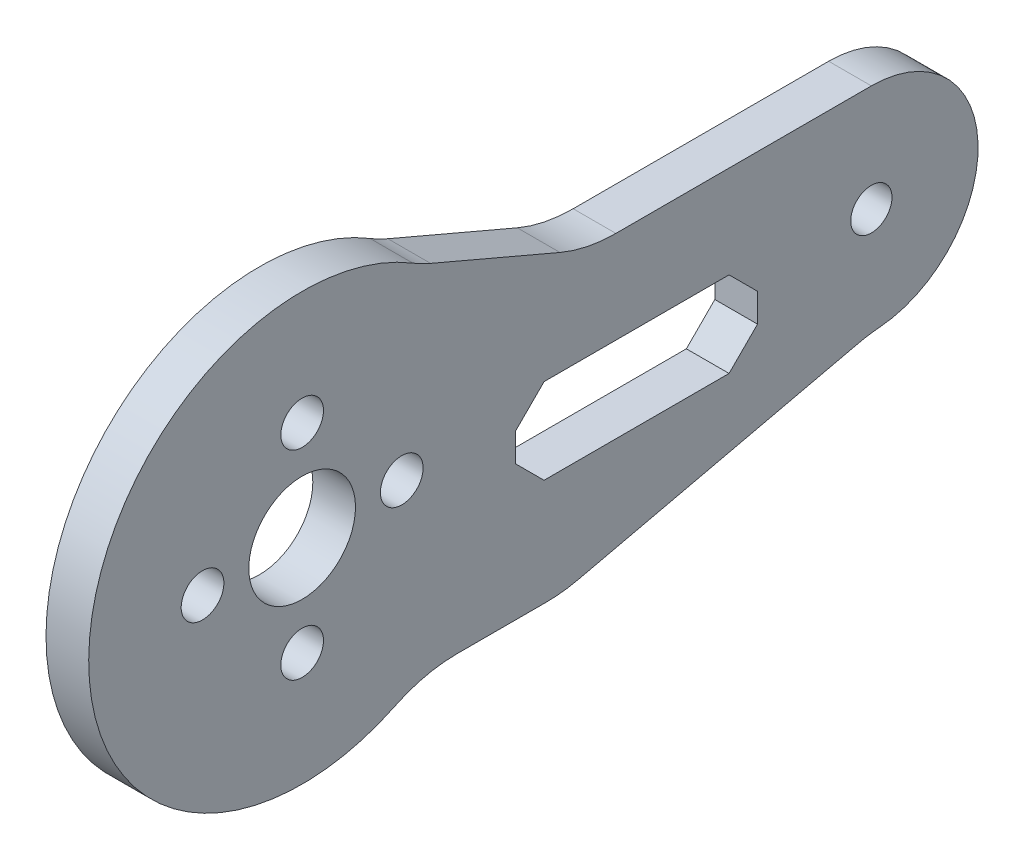
ISO-10303-21;
HEADER;
FILE_DESCRIPTION(('STEP AP214'),'2;1');
FILE_NAME('part.step','',(''),(''),'','','');
FILE_SCHEMA(('AUTOMOTIVE_DESIGN { 1 0 10303 214 1 1 1 1 }'));
ENDSEC;
DATA;
#1=APPLICATION_CONTEXT('core data for automotive mechanical design processes');
#2=APPLICATION_PROTOCOL_DEFINITION('international standard','automotive_design',2000,#1);
#3=PRODUCT_CONTEXT('',#1,'mechanical');
#4=PRODUCT('Part','Part','',(#3));
#5=PRODUCT_RELATED_PRODUCT_CATEGORY('part','',(#4));
#6=PRODUCT_DEFINITION_FORMATION('','',#4);
#7=PRODUCT_DEFINITION_CONTEXT('part definition',#1,'design');
#8=PRODUCT_DEFINITION('design','',#6,#7);
#9=PRODUCT_DEFINITION_SHAPE('','',#8);
#10=(LENGTH_UNIT() NAMED_UNIT(*) SI_UNIT(.MILLI.,.METRE.));
#11=(NAMED_UNIT(*) PLANE_ANGLE_UNIT() SI_UNIT($,.RADIAN.));
#12=(NAMED_UNIT(*) SI_UNIT($,.STERADIAN.) SOLID_ANGLE_UNIT());
#13=UNCERTAINTY_MEASURE_WITH_UNIT(LENGTH_MEASURE(1.E-05),#10,'distance_accuracy_value','');
#14=(GEOMETRIC_REPRESENTATION_CONTEXT(3) GLOBAL_UNCERTAINTY_ASSIGNED_CONTEXT((#13)) GLOBAL_UNIT_ASSIGNED_CONTEXT((#10,
#11,#12)) REPRESENTATION_CONTEXT('',''));
#15=CARTESIAN_POINT('',(0.,0.,0.));
#16=DIRECTION('',(0.,0.,1.));
#17=DIRECTION('',(1.,0.,0.));
#18=AXIS2_PLACEMENT_3D('',#15,#16,#17);
#19=CARTESIAN_POINT('',(1.5,-15.8710529420645,-3.65550320212734));
#20=DIRECTION('',(0.,-0.974485917760071,-0.224448649110017));
#21=DIRECTION('',(0.,0.224448649110017,-0.974485917760071));
#22=AXIS2_PLACEMENT_3D('',#19,#20,#21);
#23=PLANE('',#22);
#24=DIRECTION('',(0.,-0.224448649110017,0.974485917760071));
#25=VECTOR('',#24,1.);
#26=CARTESIAN_POINT('',(1.5,-15.8710529420645,-3.65550320212734));
#27=LINE('',#26,#25);
#28=CARTESIAN_POINT('',(1.5,-7.70144119055184,-39.1254052798804));
#29=VERTEX_POINT('',#28);
#30=CARTESIAN_POINT('',(1.5,-12.2448591776007,-19.3993037219836));
#31=VERTEX_POINT('',#30);
#32=EDGE_CURVE('E234',#29,#31,#27,.T.);
#33=ORIENTED_EDGE('',*,*,#32,.T.);
#34=DIRECTION('',(-1.,0.,0.));
#35=VECTOR('',#34,1.);
#36=CARTESIAN_POINT('',(1.5,-12.2448591776007,-19.3993037219836));
#37=LINE('',#36,#35);
#38=CARTESIAN_POINT('',(-1.5,-12.2448591776007,-19.3993037219836));
#39=VERTEX_POINT('',#38);
#40=EDGE_CURVE('E308',#31,#39,#37,.T.);
#41=ORIENTED_EDGE('',*,*,#40,.T.);
#42=DIRECTION('',(0.,-0.224448649110017,0.974485917760071));
#43=VECTOR('',#42,1.);
#44=CARTESIAN_POINT('',(-1.5,-15.8710529420645,-3.65550320212734));
#45=LINE('',#44,#43);
#46=CARTESIAN_POINT('',(-1.5,-7.70144119055184,-39.1254052798804));
#47=VERTEX_POINT('',#46);
#48=EDGE_CURVE('E222',#47,#39,#45,.T.);
#49=ORIENTED_EDGE('',*,*,#48,.F.);
#50=DIRECTION('',(-1.,0.,0.));
#51=VECTOR('',#50,1.);
#52=CARTESIAN_POINT('',(1.5,-7.70144119055184,-39.1254052798804));
#53=LINE('',#52,#51);
#54=EDGE_CURVE('E306',#47,#29,#53,.F.);
#55=ORIENTED_EDGE('',*,*,#54,.T.);
#56=EDGE_LOOP('',(#33,#41,#49,#55));
#57=FACE_BOUND('',#56,.T.);
#58=ADVANCED_FACE('F35',(#57),#23,.T.);
#59=CARTESIAN_POINT('',(1.5,0.,-40.));
#60=DIRECTION('',(-1.,0.,0.));
#61=DIRECTION('',(0.,0.,1.));
#62=AXIS2_PLACEMENT_3D('',#59,#60,#61);
#63=CYLINDRICAL_SURFACE('',#62,7.5);
#64=CARTESIAN_POINT('',(1.5,0.,-40.));
#65=DIRECTION('',(1.,0.,0.));
#66=DIRECTION('',(0.,0.,-1.));
#67=AXIS2_PLACEMENT_3D('',#64,#65,#66);
#68=CIRCLE('',#67,7.5);
#69=CARTESIAN_POINT('',(1.5,-7.47698587206538,-40.5870964732774));
#70=VERTEX_POINT('',#69);
#71=CARTESIAN_POINT('',(1.5,7.5,-40.));
#72=VERTEX_POINT('',#71);
#73=EDGE_CURVE('E237',#70,#72,#68,.T.);
#74=ORIENTED_EDGE('',*,*,#73,.F.);
#75=DIRECTION('',(-1.,0.,0.));
#76=VECTOR('',#75,1.);
#77=CARTESIAN_POINT('',(1.5,-7.47698587206538,-40.5870964732774));
#78=LINE('',#77,#76);
#79=CARTESIAN_POINT('',(-1.5,-7.47698587206538,-40.5870964732774));
#80=VERTEX_POINT('',#79);
#81=EDGE_CURVE('E332',#70,#80,#78,.T.);
#82=ORIENTED_EDGE('',*,*,#81,.T.);
#83=CARTESIAN_POINT('',(-1.5,0.,-40.));
#84=DIRECTION('',(1.,0.,0.));
#85=DIRECTION('',(0.,0.,-1.));
#86=AXIS2_PLACEMENT_3D('',#83,#84,#85);
#87=CIRCLE('',#86,7.5);
#88=CARTESIAN_POINT('',(-1.5,7.5,-40.));
#89=VERTEX_POINT('',#88);
#90=EDGE_CURVE('E273',#80,#89,#87,.T.);
#91=ORIENTED_EDGE('',*,*,#90,.T.);
#92=DIRECTION('',(-1.,0.,0.));
#93=VECTOR('',#92,1.);
#94=CARTESIAN_POINT('',(1.5,7.5,-40.));
#95=LINE('',#94,#93);
#96=EDGE_CURVE('E270',#72,#89,#95,.T.);
#97=ORIENTED_EDGE('',*,*,#96,.F.);
#98=EDGE_LOOP('',(#74,#82,#91,#97));
#99=FACE_BOUND('',#98,.T.);
#100=ADVANCED_FACE('F379',(#99),#63,.T.);
#101=CARTESIAN_POINT('',(1.5,7.49999999999999,0.));
#102=DIRECTION('',(0.,-1.,0.));
#103=DIRECTION('',(0.,0.,-1.));
#104=AXIS2_PLACEMENT_3D('',#101,#102,#103);
#105=PLANE('',#104);
#106=DIRECTION('',(0.,0.,1.));
#107=VECTOR('',#106,1.);
#108=CARTESIAN_POINT('',(-1.5,7.49999999999999,0.));
#109=LINE('',#108,#107);
#110=CARTESIAN_POINT('',(-1.5,7.5,-22.0458434423939));
#111=VERTEX_POINT('',#110);
#112=EDGE_CURVE('E275',#89,#111,#109,.T.);
#113=ORIENTED_EDGE('',*,*,#112,.T.);
#114=DIRECTION('',(-1.,0.,0.));
#115=VECTOR('',#114,1.);
#116=CARTESIAN_POINT('',(1.5,7.5,-22.0458434423939));
#117=LINE('',#116,#115);
#118=CARTESIAN_POINT('',(1.5,7.5,-22.0458434423939));
#119=VERTEX_POINT('',#118);
#120=EDGE_CURVE('E330',#111,#119,#117,.F.);
#121=ORIENTED_EDGE('',*,*,#120,.T.);
#122=DIRECTION('',(0.,0.,1.));
#123=VECTOR('',#122,1.);
#124=CARTESIAN_POINT('',(1.5,7.49999999999999,0.));
#125=LINE('',#124,#123);
#126=EDGE_CURVE('E240',#72,#119,#125,.T.);
#127=ORIENTED_EDGE('',*,*,#126,.F.);
#128=ORIENTED_EDGE('',*,*,#96,.T.);
#129=EDGE_LOOP('',(#113,#121,#127,#128));
#130=FACE_BOUND('',#129,.T.);
#131=ADVANCED_FACE('F384',(#130),#105,.F.);
#132=CARTESIAN_POINT('',(1.5,13.5667458948105,-5.79357633651566));
#133=DIRECTION('',(0.,-0.919653380184007,0.392731027951867));
#134=DIRECTION('',(0.,-0.392731027951867,-0.919653380184007));
#135=AXIS2_PLACEMENT_3D('',#132,#133,#134);
#136=PLANE('',#135);
#137=DIRECTION('',(0.,0.392731027951867,0.919653380184007));
#138=VECTOR('',#137,1.);
#139=CARTESIAN_POINT('',(-1.5,13.5667458948105,-5.79357633651566));
#140=LINE('',#139,#138);
#141=CARTESIAN_POINT('',(-1.5,8.30346619815993,-18.1185331628752));
#142=VERTEX_POINT('',#141);
#143=CARTESIAN_POINT('',(-1.5,12.1872890829508,-9.02383325423514));
#144=VERTEX_POINT('',#143);
#145=EDGE_CURVE('E278',#142,#144,#140,.T.);
#146=ORIENTED_EDGE('',*,*,#145,.T.);
#147=DIRECTION('',(1.,0.,0.));
#148=VECTOR('',#147,1.);
#149=CARTESIAN_POINT('',(1.5,12.1872890829508,-9.02383325423514));
#150=LINE('',#149,#148);
#151=CARTESIAN_POINT('',(1.5,12.1872890829508,-9.02383325423514));
#152=VERTEX_POINT('',#151);
#153=EDGE_CURVE('E328',#144,#152,#150,.T.);
#154=ORIENTED_EDGE('',*,*,#153,.T.);
#155=DIRECTION('',(0.,0.392731027951867,0.919653380184007));
#156=VECTOR('',#155,1.);
#157=CARTESIAN_POINT('',(1.5,13.5667458948105,-5.79357633651566));
#158=LINE('',#157,#156);
#159=CARTESIAN_POINT('',(1.5,8.30346619815993,-18.1185331628752));
#160=VERTEX_POINT('',#159);
#161=EDGE_CURVE('E243',#160,#152,#158,.T.);
#162=ORIENTED_EDGE('',*,*,#161,.F.);
#163=DIRECTION('',(-1.,0.,0.));
#164=VECTOR('',#163,1.);
#165=CARTESIAN_POINT('',(-1.5,8.30346619815993,-18.1185331628752));
#166=LINE('',#165,#164);
#167=EDGE_CURVE('E325',#160,#142,#166,.T.);
#168=ORIENTED_EDGE('',*,*,#167,.T.);
#169=EDGE_LOOP('',(#146,#154,#162,#168));
#170=FACE_BOUND('',#169,.T.);
#171=ADVANCED_FACE('F393',(#170),#136,.F.);
#172=CARTESIAN_POINT('',(1.5,0.,0.));
#173=DIRECTION('',(-1.,0.,0.));
#174=DIRECTION('',(0.,0.,1.));
#175=AXIS2_PLACEMENT_3D('',#172,#173,#174);
#176=CYLINDRICAL_SURFACE('',#175,15.);
#177=CARTESIAN_POINT('',(1.5,0.,0.));
#178=DIRECTION('',(1.,0.,0.));
#179=DIRECTION('',(0.,0.,-1.));
#180=AXIS2_PLACEMENT_3D('',#177,#178,#179);
#181=CIRCLE('',#180,15.);
#182=CARTESIAN_POINT('',(1.5,12.8302937308745,-7.77068612025229));
#183=VERTEX_POINT('',#182);
#184=CARTESIAN_POINT('',(1.5,-13.5,-6.53834841531101));
#185=VERTEX_POINT('',#184);
#186=EDGE_CURVE('E246',#183,#185,#181,.T.);
#187=ORIENTED_EDGE('',*,*,#186,.F.);
#188=DIRECTION('',(-1.,0.,0.));
#189=VECTOR('',#188,1.);
#190=CARTESIAN_POINT('',(1.5,12.8302937308745,-7.77068612025229));
#191=LINE('',#190,#189);
#192=CARTESIAN_POINT('',(-1.5,12.8302937308745,-7.77068612025229));
#193=VERTEX_POINT('',#192);
#194=EDGE_CURVE('E322',#183,#193,#191,.T.);
#195=ORIENTED_EDGE('',*,*,#194,.T.);
#196=CARTESIAN_POINT('',(-1.5,0.,0.));
#197=DIRECTION('',(1.,0.,0.));
#198=DIRECTION('',(0.,0.,-1.));
#199=AXIS2_PLACEMENT_3D('',#196,#197,#198);
#200=CIRCLE('',#199,15.);
#201=CARTESIAN_POINT('',(-1.5,-13.5,-6.53834841531101));
#202=VERTEX_POINT('',#201);
#203=EDGE_CURVE('E281',#193,#202,#200,.T.);
#204=ORIENTED_EDGE('',*,*,#203,.T.);
#205=DIRECTION('',(-1.,0.,0.));
#206=VECTOR('',#205,1.);
#207=CARTESIAN_POINT('',(1.5,-13.5,-6.53834841531101));
#208=LINE('',#207,#206);
#209=EDGE_CURVE('E320',#202,#185,#208,.F.);
#210=ORIENTED_EDGE('',*,*,#209,.T.);
#211=EDGE_LOOP('',(#187,#195,#204,#210));
#212=FACE_BOUND('',#211,.T.);
#213=ADVANCED_FACE('F354',(#212),#176,.T.);
#214=CARTESIAN_POINT('',(1.5,-7.,0.));
#215=DIRECTION('',(-1.,0.,0.));
#216=DIRECTION('',(0.,0.,1.));
#217=AXIS2_PLACEMENT_3D('',#214,#215,#216);
#218=CYLINDRICAL_SURFACE('',#217,1.5);
#219=CARTESIAN_POINT('',(1.5,-7.,0.));
#220=DIRECTION('',(1.,0.,0.));
#221=DIRECTION('',(0.,0.,-1.));
#222=AXIS2_PLACEMENT_3D('',#219,#220,#221);
#223=CIRCLE('',#222,1.5);
#224=CARTESIAN_POINT('',(1.5,-7.,-1.5));
#225=VERTEX_POINT('',#224);
#226=EDGE_CURVE('E264',#225,#225,#223,.T.);
#227=ORIENTED_EDGE('',*,*,#226,.T.);
#228=EDGE_LOOP('',(#227));
#229=FACE_BOUND('',#228,.T.);
#230=CARTESIAN_POINT('',(-1.5,-7.,0.));
#231=DIRECTION('',(1.,0.,0.));
#232=DIRECTION('',(0.,0.,-1.));
#233=AXIS2_PLACEMENT_3D('',#230,#231,#232);
#234=CIRCLE('',#233,1.5);
#235=CARTESIAN_POINT('',(-1.5,-7.,-1.5));
#236=VERTEX_POINT('',#235);
#237=EDGE_CURVE('E299',#236,#236,#234,.T.);
#238=ORIENTED_EDGE('',*,*,#237,.F.);
#239=EDGE_LOOP('',(#238));
#240=FACE_BOUND('',#239,.T.);
#241=ADVANCED_FACE('F419',(#229,#240),#218,.F.);
#242=CARTESIAN_POINT('',(1.5,7.,0.));
#243=DIRECTION('',(-1.,0.,0.));
#244=DIRECTION('',(0.,0.,1.));
#245=AXIS2_PLACEMENT_3D('',#242,#243,#244);
#246=CYLINDRICAL_SURFACE('',#245,1.5);
#247=CARTESIAN_POINT('',(1.5,7.,0.));
#248=DIRECTION('',(1.,0.,0.));
#249=DIRECTION('',(0.,0.,-1.));
#250=AXIS2_PLACEMENT_3D('',#247,#248,#249);
#251=CIRCLE('',#250,1.5);
#252=CARTESIAN_POINT('',(1.5,7.,-1.5));
#253=VERTEX_POINT('',#252);
#254=EDGE_CURVE('E261',#253,#253,#251,.T.);
#255=ORIENTED_EDGE('',*,*,#254,.T.);
#256=EDGE_LOOP('',(#255));
#257=FACE_BOUND('',#256,.T.);
#258=CARTESIAN_POINT('',(-1.5,7.,0.));
#259=DIRECTION('',(1.,0.,0.));
#260=DIRECTION('',(0.,0.,-1.));
#261=AXIS2_PLACEMENT_3D('',#258,#259,#260);
#262=CIRCLE('',#261,1.5);
#263=CARTESIAN_POINT('',(-1.5,7.,-1.5));
#264=VERTEX_POINT('',#263);
#265=EDGE_CURVE('E296',#264,#264,#262,.T.);
#266=ORIENTED_EDGE('',*,*,#265,.F.);
#267=EDGE_LOOP('',(#266));
#268=FACE_BOUND('',#267,.T.);
#269=ADVANCED_FACE('F434',(#257,#268),#246,.F.);
#270=CARTESIAN_POINT('',(1.5,0.,0.));
#271=DIRECTION('',(-1.,0.,0.));
#272=DIRECTION('',(0.,0.,1.));
#273=AXIS2_PLACEMENT_3D('',#270,#271,#272);
#274=CYLINDRICAL_SURFACE('',#273,3.75);
#275=CARTESIAN_POINT('',(1.5,0.,0.));
#276=DIRECTION('',(1.,0.,0.));
#277=DIRECTION('',(0.,0.,-1.));
#278=AXIS2_PLACEMENT_3D('',#275,#276,#277);
#279=CIRCLE('',#278,3.75);
#280=CARTESIAN_POINT('',(1.5,0.,-3.75));
#281=VERTEX_POINT('',#280);
#282=EDGE_CURVE('E258',#281,#281,#279,.T.);
#283=ORIENTED_EDGE('',*,*,#282,.T.);
#284=EDGE_LOOP('',(#283));
#285=FACE_BOUND('',#284,.T.);
#286=CARTESIAN_POINT('',(-1.5,0.,0.));
#287=DIRECTION('',(1.,0.,0.));
#288=DIRECTION('',(0.,0.,-1.));
#289=AXIS2_PLACEMENT_3D('',#286,#287,#288);
#290=CIRCLE('',#289,3.75);
#291=CARTESIAN_POINT('',(-1.5,0.,-3.75));
#292=VERTEX_POINT('',#291);
#293=EDGE_CURVE('E293',#292,#292,#290,.T.);
#294=ORIENTED_EDGE('',*,*,#293,.F.);
#295=EDGE_LOOP('',(#294));
#296=FACE_BOUND('',#295,.T.);
#297=ADVANCED_FACE('F430',(#285,#296),#274,.F.);
#298=CARTESIAN_POINT('',(1.5,0.,7.));
#299=DIRECTION('',(-1.,0.,0.));
#300=DIRECTION('',(0.,0.,1.));
#301=AXIS2_PLACEMENT_3D('',#298,#299,#300);
#302=CYLINDRICAL_SURFACE('',#301,1.5);
#303=CARTESIAN_POINT('',(1.5,0.,7.));
#304=DIRECTION('',(1.,0.,0.));
#305=DIRECTION('',(0.,0.,-1.));
#306=AXIS2_PLACEMENT_3D('',#303,#304,#305);
#307=CIRCLE('',#306,1.5);
#308=CARTESIAN_POINT('',(1.5,0.,5.5));
#309=VERTEX_POINT('',#308);
#310=EDGE_CURVE('E255',#309,#309,#307,.T.);
#311=ORIENTED_EDGE('',*,*,#310,.T.);
#312=EDGE_LOOP('',(#311));
#313=FACE_BOUND('',#312,.T.);
#314=CARTESIAN_POINT('',(-1.5,0.,7.));
#315=DIRECTION('',(1.,0.,0.));
#316=DIRECTION('',(0.,0.,-1.));
#317=AXIS2_PLACEMENT_3D('',#314,#315,#316);
#318=CIRCLE('',#317,1.5);
#319=CARTESIAN_POINT('',(-1.5,0.,5.5));
#320=VERTEX_POINT('',#319);
#321=EDGE_CURVE('E290',#320,#320,#318,.T.);
#322=ORIENTED_EDGE('',*,*,#321,.F.);
#323=EDGE_LOOP('',(#322));
#324=FACE_BOUND('',#323,.T.);
#325=ADVANCED_FACE('F426',(#313,#324),#302,.F.);
#326=CARTESIAN_POINT('',(1.5,0.,-7.));
#327=DIRECTION('',(-1.,0.,0.));
#328=DIRECTION('',(0.,0.,1.));
#329=AXIS2_PLACEMENT_3D('',#326,#327,#328);
#330=CYLINDRICAL_SURFACE('',#329,1.5);
#331=CARTESIAN_POINT('',(1.5,0.,-7.));
#332=DIRECTION('',(1.,0.,0.));
#333=DIRECTION('',(0.,0.,-1.));
#334=AXIS2_PLACEMENT_3D('',#331,#332,#333);
#335=CIRCLE('',#334,1.5);
#336=CARTESIAN_POINT('',(1.5,0.,-8.5));
#337=VERTEX_POINT('',#336);
#338=EDGE_CURVE('E252',#337,#337,#335,.T.);
#339=ORIENTED_EDGE('',*,*,#338,.T.);
#340=EDGE_LOOP('',(#339));
#341=FACE_BOUND('',#340,.T.);
#342=CARTESIAN_POINT('',(-1.5,0.,-7.));
#343=DIRECTION('',(1.,0.,0.));
#344=DIRECTION('',(0.,0.,-1.));
#345=AXIS2_PLACEMENT_3D('',#342,#343,#344);
#346=CIRCLE('',#345,1.5);
#347=CARTESIAN_POINT('',(-1.5,0.,-8.5));
#348=VERTEX_POINT('',#347);
#349=EDGE_CURVE('E287',#348,#348,#346,.T.);
#350=ORIENTED_EDGE('',*,*,#349,.F.);
#351=EDGE_LOOP('',(#350));
#352=FACE_BOUND('',#351,.T.);
#353=ADVANCED_FACE('F423',(#341,#352),#330,.F.);
#354=CARTESIAN_POINT('',(1.5,-12.5,0.));
#355=DIRECTION('',(0.,-1.,0.));
#356=DIRECTION('',(0.,0.,-1.));
#357=AXIS2_PLACEMENT_3D('',#354,#355,#356);
#358=PLANE('',#357);
#359=DIRECTION('',(0.,0.,1.));
#360=VECTOR('',#359,1.);
#361=CARTESIAN_POINT('',(-1.5,-12.5,0.));
#362=LINE('',#361,#360);
#363=CARTESIAN_POINT('',(-1.5,-12.5,-17.1548172308835));
#364=VERTEX_POINT('',#363);
#365=CARTESIAN_POINT('',(-1.5,-12.5,-10.8972473588517));
#366=VERTEX_POINT('',#365);
#367=EDGE_CURVE('E284',#364,#366,#362,.T.);
#368=ORIENTED_EDGE('',*,*,#367,.F.);
#369=DIRECTION('',(-1.,0.,0.));
#370=VECTOR('',#369,1.);
#371=CARTESIAN_POINT('',(1.5,-12.5,-17.1548172308835));
#372=LINE('',#371,#370);
#373=CARTESIAN_POINT('',(1.5,-12.5,-17.1548172308835));
#374=VERTEX_POINT('',#373);
#375=EDGE_CURVE('E316',#364,#374,#372,.F.);
#376=ORIENTED_EDGE('',*,*,#375,.T.);
#377=DIRECTION('',(0.,0.,1.));
#378=VECTOR('',#377,1.);
#379=CARTESIAN_POINT('',(1.5,-12.5,0.));
#380=LINE('',#379,#378);
#381=CARTESIAN_POINT('',(1.5,-12.5,-10.8972473588517));
#382=VERTEX_POINT('',#381);
#383=EDGE_CURVE('E249',#374,#382,#380,.T.);
#384=ORIENTED_EDGE('',*,*,#383,.T.);
#385=DIRECTION('',(-1.,0.,0.));
#386=VECTOR('',#385,1.);
#387=CARTESIAN_POINT('',(1.5,-12.5,-10.8972473588517));
#388=LINE('',#387,#386);
#389=EDGE_CURVE('E313',#382,#366,#388,.T.);
#390=ORIENTED_EDGE('',*,*,#389,.T.);
#391=EDGE_LOOP('',(#368,#376,#384,#390));
#392=FACE_BOUND('',#391,.T.);
#393=ADVANCED_FACE('F363',(#392),#358,.T.);
#394=CARTESIAN_POINT('',(1.5,0.,-40.));
#395=DIRECTION('',(-1.,0.,0.));
#396=DIRECTION('',(0.,0.,1.));
#397=AXIS2_PLACEMENT_3D('',#394,#395,#396);
#398=CYLINDRICAL_SURFACE('',#397,1.45);
#399=CARTESIAN_POINT('',(1.5,0.,-40.));
#400=DIRECTION('',(1.,0.,0.));
#401=DIRECTION('',(0.,0.,-1.));
#402=AXIS2_PLACEMENT_3D('',#399,#400,#401);
#403=CIRCLE('',#402,1.45);
#404=CARTESIAN_POINT('',(1.5,0.,-41.45));
#405=VERTEX_POINT('',#404);
#406=EDGE_CURVE('E267',#405,#405,#403,.T.);
#407=ORIENTED_EDGE('',*,*,#406,.T.);
#408=EDGE_LOOP('',(#407));
#409=FACE_BOUND('',#408,.T.);
#410=CARTESIAN_POINT('',(-1.5,0.,-40.));
#411=DIRECTION('',(1.,0.,0.));
#412=DIRECTION('',(0.,0.,-1.));
#413=AXIS2_PLACEMENT_3D('',#410,#411,#412);
#414=CIRCLE('',#413,1.45);
#415=CARTESIAN_POINT('',(-1.5,0.,-41.45));
#416=VERTEX_POINT('',#415);
#417=EDGE_CURVE('E238',#416,#416,#414,.T.);
#418=ORIENTED_EDGE('',*,*,#417,.F.);
#419=EDGE_LOOP('',(#418));
#420=FACE_BOUND('',#419,.T.);
#421=ADVANCED_FACE('F422',(#409,#420),#398,.F.);
#422=CARTESIAN_POINT('',(1.5,0.,0.));
#423=DIRECTION('',(1.,0.,0.));
#424=DIRECTION('',(0.,0.,-1.));
#425=AXIS2_PLACEMENT_3D('',#422,#423,#424);
#426=PLANE('',#425);
#427=DIRECTION('',(0.,-0.707106781186547,0.707106781186548));
#428=VECTOR('',#427,1.);
#429=CARTESIAN_POINT('',(1.5,-1.,-15.));
#430=LINE('',#429,#428);
#431=CARTESIAN_POINT('',(1.5,1.,-17.));
#432=VERTEX_POINT('',#431);
#433=CARTESIAN_POINT('',(1.5,-1.,-15.));
#434=VERTEX_POINT('',#433);
#435=EDGE_CURVE('E50',#432,#434,#430,.T.);
#436=ORIENTED_EDGE('',*,*,#435,.F.);
#437=DIRECTION('',(0.,0.,1.));
#438=VECTOR('',#437,1.);
#439=CARTESIAN_POINT('',(1.5,1.,-17.));
#440=LINE('',#439,#438);
#441=CARTESIAN_POINT('',(1.5,1.,-30.));
#442=VERTEX_POINT('',#441);
#443=EDGE_CURVE('E184',#442,#432,#440,.T.);
#444=ORIENTED_EDGE('',*,*,#443,.F.);
#445=DIRECTION('',(0.,0.707106781186547,0.707106781186548));
#446=VECTOR('',#445,1.);
#447=CARTESIAN_POINT('',(1.5,1.,-30.));
#448=LINE('',#447,#446);
#449=CARTESIAN_POINT('',(1.5,-1.,-32.));
#450=VERTEX_POINT('',#449);
#451=EDGE_CURVE('E187',#450,#442,#448,.T.);
#452=ORIENTED_EDGE('',*,*,#451,.F.);
#453=DIRECTION('',(0.,1.,0.));
#454=VECTOR('',#453,1.);
#455=CARTESIAN_POINT('',(1.5,-1.,-32.));
#456=LINE('',#455,#454);
#457=CARTESIAN_POINT('',(1.5,-3.,-32.));
#458=VERTEX_POINT('',#457);
#459=EDGE_CURVE('E215',#458,#450,#456,.T.);
#460=ORIENTED_EDGE('',*,*,#459,.F.);
#461=DIRECTION('',(0.,0.707106781186547,-0.707106781186548));
#462=VECTOR('',#461,1.);
#463=CARTESIAN_POINT('',(1.5,-5.,-30.));
#464=LINE('',#463,#462);
#465=CARTESIAN_POINT('',(1.5,-5.,-30.));
#466=VERTEX_POINT('',#465);
#467=EDGE_CURVE('E212',#466,#458,#464,.T.);
#468=ORIENTED_EDGE('',*,*,#467,.F.);
#469=DIRECTION('',(0.,0.,-1.));
#470=VECTOR('',#469,1.);
#471=CARTESIAN_POINT('',(1.5,-5.,-17.));
#472=LINE('',#471,#470);
#473=CARTESIAN_POINT('',(1.5,-5.,-17.));
#474=VERTEX_POINT('',#473);
#475=EDGE_CURVE('E209',#474,#466,#472,.T.);
#476=ORIENTED_EDGE('',*,*,#475,.F.);
#477=DIRECTION('',(0.,-0.707106781186547,-0.707106781186548));
#478=VECTOR('',#477,1.);
#479=CARTESIAN_POINT('',(1.5,-3.,-15.));
#480=LINE('',#479,#478);
#481=CARTESIAN_POINT('',(1.5,-3.,-15.));
#482=VERTEX_POINT('',#481);
#483=EDGE_CURVE('E206',#482,#474,#480,.T.);
#484=ORIENTED_EDGE('',*,*,#483,.F.);
#485=DIRECTION('',(0.,-1.,0.));
#486=VECTOR('',#485,1.);
#487=CARTESIAN_POINT('',(1.5,-1.,-15.));
#488=LINE('',#487,#486);
#489=EDGE_CURVE('E204',#434,#482,#488,.T.);
#490=ORIENTED_EDGE('',*,*,#489,.F.);
#491=EDGE_LOOP('',(#436,#444,#452,#460,#468,#476,#484,#490));
#492=FACE_BOUND('',#491,.T.);
#493=ORIENTED_EDGE('',*,*,#383,.F.);
#494=CARTESIAN_POINT('',(1.5,-2.5,-17.1548172308835));
#495=DIRECTION('',(1.,0.,0.));
#496=DIRECTION('',(0.,0.,-1.));
#497=AXIS2_PLACEMENT_3D('',#494,#495,#496);
#498=CIRCLE('',#497,10.);
#499=EDGE_CURVE('E318',#374,#31,#498,.T.);
#500=ORIENTED_EDGE('',*,*,#499,.T.);
#501=ORIENTED_EDGE('',*,*,#32,.F.);
#502=CARTESIAN_POINT('',(1.5,-17.4463003681525,-41.3698917709806));
#503=DIRECTION('',(1.,0.,0.));
#504=DIRECTION('',(0.,0.,-1.));
#505=AXIS2_PLACEMENT_3D('',#502,#503,#504);
#506=CIRCLE('',#505,10.);
#507=EDGE_CURVE('E345',#29,#70,#506,.F.);
#508=ORIENTED_EDGE('',*,*,#507,.T.);
#509=ORIENTED_EDGE('',*,*,#73,.T.);
#510=ORIENTED_EDGE('',*,*,#126,.T.);
#511=CARTESIAN_POINT('',(1.5,17.5,-22.0458434423939));
#512=DIRECTION('',(1.,0.,0.));
#513=DIRECTION('',(0.,0.,-1.));
#514=AXIS2_PLACEMENT_3D('',#511,#512,#513);
#515=CIRCLE('',#514,10.);
#516=EDGE_CURVE('E341',#119,#160,#515,.F.);
#517=ORIENTED_EDGE('',*,*,#516,.T.);
#518=ORIENTED_EDGE('',*,*,#161,.T.);
#519=CARTESIAN_POINT('',(1.5,21.3838228847909,-12.9511435337538));
#520=DIRECTION('',(1.,0.,0.));
#521=DIRECTION('',(0.,0.,-1.));
#522=AXIS2_PLACEMENT_3D('',#519,#520,#521);
#523=CIRCLE('',#522,10.);
#524=EDGE_CURVE('E337',#152,#183,#523,.F.);
#525=ORIENTED_EDGE('',*,*,#524,.T.);
#526=ORIENTED_EDGE('',*,*,#186,.T.);
#527=CARTESIAN_POINT('',(1.5,-22.5,-10.8972473588517));
#528=DIRECTION('',(1.,0.,0.));
#529=DIRECTION('',(0.,0.,-1.));
#530=AXIS2_PLACEMENT_3D('',#527,#528,#529);
#531=CIRCLE('',#530,10.);
#532=EDGE_CURVE('E11',#185,#382,#531,.F.);
#533=ORIENTED_EDGE('',*,*,#532,.T.);
#534=EDGE_LOOP('',(#493,#500,#501,#508,#509,#510,#517,#518,#525,#526,#533));
#535=FACE_BOUND('',#534,.T.);
#536=ORIENTED_EDGE('',*,*,#338,.F.);
#537=EDGE_LOOP('',(#536));
#538=FACE_BOUND('',#537,.T.);
#539=ORIENTED_EDGE('',*,*,#310,.F.);
#540=EDGE_LOOP('',(#539));
#541=FACE_BOUND('',#540,.T.);
#542=ORIENTED_EDGE('',*,*,#282,.F.);
#543=EDGE_LOOP('',(#542));
#544=FACE_BOUND('',#543,.T.);
#545=ORIENTED_EDGE('',*,*,#254,.F.);
#546=EDGE_LOOP('',(#545));
#547=FACE_BOUND('',#546,.T.);
#548=ORIENTED_EDGE('',*,*,#226,.F.);
#549=EDGE_LOOP('',(#548));
#550=FACE_BOUND('',#549,.T.);
#551=ORIENTED_EDGE('',*,*,#406,.F.);
#552=EDGE_LOOP('',(#551));
#553=FACE_BOUND('',#552,.T.);
#554=ADVANCED_FACE('F359',(#492,#535,#538,#541,#544,#547,#550,#553),#426,.T.);
#555=CARTESIAN_POINT('',(-1.5,0.,0.));
#556=DIRECTION('',(1.,0.,0.));
#557=DIRECTION('',(0.,0.,-1.));
#558=AXIS2_PLACEMENT_3D('',#555,#556,#557);
#559=PLANE('',#558);
#560=DIRECTION('',(0.,0.,1.));
#561=VECTOR('',#560,1.);
#562=CARTESIAN_POINT('',(-1.5,1.,-17.));
#563=LINE('',#562,#561);
#564=CARTESIAN_POINT('',(-1.5,1.,-30.));
#565=VERTEX_POINT('',#564);
#566=CARTESIAN_POINT('',(-1.5,1.,-17.));
#567=VERTEX_POINT('',#566);
#568=EDGE_CURVE('E173',#565,#567,#563,.T.);
#569=ORIENTED_EDGE('',*,*,#568,.T.);
#570=DIRECTION('',(0.,-0.707106781186547,0.707106781186548));
#571=VECTOR('',#570,1.);
#572=CARTESIAN_POINT('',(-1.5,-1.,-15.));
#573=LINE('',#572,#571);
#574=CARTESIAN_POINT('',(-1.5,-1.,-15.));
#575=VERTEX_POINT('',#574);
#576=EDGE_CURVE('E167',#567,#575,#573,.T.);
#577=ORIENTED_EDGE('',*,*,#576,.T.);
#578=DIRECTION('',(0.,-1.,0.));
#579=VECTOR('',#578,1.);
#580=CARTESIAN_POINT('',(-1.5,-1.,-15.));
#581=LINE('',#580,#579);
#582=CARTESIAN_POINT('',(-1.5,-3.,-15.));
#583=VERTEX_POINT('',#582);
#584=EDGE_CURVE('E176',#575,#583,#581,.T.);
#585=ORIENTED_EDGE('',*,*,#584,.T.);
#586=DIRECTION('',(0.,-0.707106781186547,-0.707106781186548));
#587=VECTOR('',#586,1.);
#588=CARTESIAN_POINT('',(-1.5,-3.,-15.));
#589=LINE('',#588,#587);
#590=CARTESIAN_POINT('',(-1.5,-5.,-17.));
#591=VERTEX_POINT('',#590);
#592=EDGE_CURVE('E58',#583,#591,#589,.T.);
#593=ORIENTED_EDGE('',*,*,#592,.T.);
#594=DIRECTION('',(0.,0.,-1.));
#595=VECTOR('',#594,1.);
#596=CARTESIAN_POINT('',(-1.5,-5.,-17.));
#597=LINE('',#596,#595);
#598=CARTESIAN_POINT('',(-1.5,-5.,-30.));
#599=VERTEX_POINT('',#598);
#600=EDGE_CURVE('E191',#591,#599,#597,.T.);
#601=ORIENTED_EDGE('',*,*,#600,.T.);
#602=DIRECTION('',(0.,0.707106781186547,-0.707106781186548));
#603=VECTOR('',#602,1.);
#604=CARTESIAN_POINT('',(-1.5,-5.,-30.));
#605=LINE('',#604,#603);
#606=CARTESIAN_POINT('',(-1.5,-3.,-32.));
#607=VERTEX_POINT('',#606);
#608=EDGE_CURVE('E194',#599,#607,#605,.T.);
#609=ORIENTED_EDGE('',*,*,#608,.T.);
#610=DIRECTION('',(0.,1.,0.));
#611=VECTOR('',#610,1.);
#612=CARTESIAN_POINT('',(-1.5,-1.,-32.));
#613=LINE('',#612,#611);
#614=CARTESIAN_POINT('',(-1.5,-1.,-32.));
#615=VERTEX_POINT('',#614);
#616=EDGE_CURVE('E197',#607,#615,#613,.T.);
#617=ORIENTED_EDGE('',*,*,#616,.T.);
#618=DIRECTION('',(0.,0.707106781186547,0.707106781186548));
#619=VECTOR('',#618,1.);
#620=CARTESIAN_POINT('',(-1.5,1.,-30.));
#621=LINE('',#620,#619);
#622=EDGE_CURVE('E200',#615,#565,#621,.T.);
#623=ORIENTED_EDGE('',*,*,#622,.T.);
#624=EDGE_LOOP('',(#569,#577,#585,#593,#601,#609,#617,#623));
#625=FACE_BOUND('',#624,.T.);
#626=ORIENTED_EDGE('',*,*,#48,.T.);
#627=CARTESIAN_POINT('',(-1.5,-2.5,-17.1548172308835));
#628=DIRECTION('',(1.,0.,0.));
#629=DIRECTION('',(0.,0.,-1.));
#630=AXIS2_PLACEMENT_3D('',#627,#628,#629);
#631=CIRCLE('',#630,10.);
#632=EDGE_CURVE('E311',#39,#364,#631,.F.);
#633=ORIENTED_EDGE('',*,*,#632,.T.);
#634=ORIENTED_EDGE('',*,*,#367,.T.);
#635=CARTESIAN_POINT('',(-1.5,-22.5,-10.8972473588517));
#636=DIRECTION('',(1.,0.,0.));
#637=DIRECTION('',(0.,0.,-1.));
#638=AXIS2_PLACEMENT_3D('',#635,#636,#637);
#639=CIRCLE('',#638,10.);
#640=EDGE_CURVE('E43',#366,#202,#639,.T.);
#641=ORIENTED_EDGE('',*,*,#640,.T.);
#642=ORIENTED_EDGE('',*,*,#203,.F.);
#643=CARTESIAN_POINT('',(-1.5,21.3838228847909,-12.9511435337538));
#644=DIRECTION('',(1.,0.,0.));
#645=DIRECTION('',(0.,0.,-1.));
#646=AXIS2_PLACEMENT_3D('',#643,#644,#645);
#647=CIRCLE('',#646,10.);
#648=EDGE_CURVE('E335',#193,#144,#647,.T.);
#649=ORIENTED_EDGE('',*,*,#648,.T.);
#650=ORIENTED_EDGE('',*,*,#145,.F.);
#651=CARTESIAN_POINT('',(-1.5,17.5,-22.0458434423939));
#652=DIRECTION('',(1.,0.,0.));
#653=DIRECTION('',(0.,0.,-1.));
#654=AXIS2_PLACEMENT_3D('',#651,#652,#653);
#655=CIRCLE('',#654,10.);
#656=EDGE_CURVE('E339',#142,#111,#655,.T.);
#657=ORIENTED_EDGE('',*,*,#656,.T.);
#658=ORIENTED_EDGE('',*,*,#112,.F.);
#659=ORIENTED_EDGE('',*,*,#90,.F.);
#660=CARTESIAN_POINT('',(-1.5,-17.4463003681525,-41.3698917709806));
#661=DIRECTION('',(1.,0.,0.));
#662=DIRECTION('',(0.,0.,-1.));
#663=AXIS2_PLACEMENT_3D('',#660,#661,#662);
#664=CIRCLE('',#663,10.);
#665=EDGE_CURVE('E343',#80,#47,#664,.T.);
#666=ORIENTED_EDGE('',*,*,#665,.T.);
#667=EDGE_LOOP('',(#626,#633,#634,#641,#642,#649,#650,#657,#658,#659,#666));
#668=FACE_BOUND('',#667,.T.);
#669=ORIENTED_EDGE('',*,*,#349,.T.);
#670=EDGE_LOOP('',(#669));
#671=FACE_BOUND('',#670,.T.);
#672=ORIENTED_EDGE('',*,*,#321,.T.);
#673=EDGE_LOOP('',(#672));
#674=FACE_BOUND('',#673,.T.);
#675=ORIENTED_EDGE('',*,*,#293,.T.);
#676=EDGE_LOOP('',(#675));
#677=FACE_BOUND('',#676,.T.);
#678=ORIENTED_EDGE('',*,*,#265,.T.);
#679=EDGE_LOOP('',(#678));
#680=FACE_BOUND('',#679,.T.);
#681=ORIENTED_EDGE('',*,*,#237,.T.);
#682=EDGE_LOOP('',(#681));
#683=FACE_BOUND('',#682,.T.);
#684=ORIENTED_EDGE('',*,*,#417,.T.);
#685=EDGE_LOOP('',(#684));
#686=FACE_BOUND('',#685,.T.);
#687=ADVANCED_FACE('F180',(#625,#668,#671,#674,#677,#680,#683,#686),#559,.F.);
#688=CARTESIAN_POINT('',(1.5,-2.5,-17.1548172308835));
#689=DIRECTION('',(-1.,0.,0.));
#690=DIRECTION('',(0.,0.,1.));
#691=AXIS2_PLACEMENT_3D('',#688,#689,#690);
#692=CYLINDRICAL_SURFACE('',#691,10.);
#693=ORIENTED_EDGE('',*,*,#499,.F.);
#694=ORIENTED_EDGE('',*,*,#375,.F.);
#695=ORIENTED_EDGE('',*,*,#632,.F.);
#696=ORIENTED_EDGE('',*,*,#40,.F.);
#697=EDGE_LOOP('',(#693,#694,#695,#696));
#698=FACE_BOUND('',#697,.T.);
#699=ADVANCED_FACE('F366',(#698),#692,.T.);
#700=CARTESIAN_POINT('',(1.5,21.3838228847909,-12.9511435337538));
#701=DIRECTION('',(-1.,0.,0.));
#702=DIRECTION('',(0.,0.,1.));
#703=AXIS2_PLACEMENT_3D('',#700,#701,#702);
#704=CYLINDRICAL_SURFACE('',#703,10.);
#705=ORIENTED_EDGE('',*,*,#524,.F.);
#706=ORIENTED_EDGE('',*,*,#153,.F.);
#707=ORIENTED_EDGE('',*,*,#648,.F.);
#708=ORIENTED_EDGE('',*,*,#194,.F.);
#709=EDGE_LOOP('',(#705,#706,#707,#708));
#710=FACE_BOUND('',#709,.T.);
#711=ADVANCED_FACE('F397',(#710),#704,.F.);
#712=CARTESIAN_POINT('',(1.5,17.5,-22.0458434423939));
#713=DIRECTION('',(1.,0.,0.));
#714=DIRECTION('',(0.,0.,-1.));
#715=AXIS2_PLACEMENT_3D('',#712,#713,#714);
#716=CYLINDRICAL_SURFACE('',#715,10.);
#717=ORIENTED_EDGE('',*,*,#516,.F.);
#718=ORIENTED_EDGE('',*,*,#120,.F.);
#719=ORIENTED_EDGE('',*,*,#656,.F.);
#720=ORIENTED_EDGE('',*,*,#167,.F.);
#721=EDGE_LOOP('',(#717,#718,#719,#720));
#722=FACE_BOUND('',#721,.T.);
#723=ADVANCED_FACE('F390',(#722),#716,.F.);
#724=CARTESIAN_POINT('',(1.5,-17.4463003681525,-41.3698917709806));
#725=DIRECTION('',(-1.,0.,0.));
#726=DIRECTION('',(0.,0.,1.));
#727=AXIS2_PLACEMENT_3D('',#724,#725,#726);
#728=CYLINDRICAL_SURFACE('',#727,10.);
#729=ORIENTED_EDGE('',*,*,#507,.F.);
#730=ORIENTED_EDGE('',*,*,#54,.F.);
#731=ORIENTED_EDGE('',*,*,#665,.F.);
#732=ORIENTED_EDGE('',*,*,#81,.F.);
#733=EDGE_LOOP('',(#729,#730,#731,#732));
#734=FACE_BOUND('',#733,.T.);
#735=ADVANCED_FACE('F374',(#734),#728,.F.);
#736=CARTESIAN_POINT('',(1.5,-22.5,-10.8972473588517));
#737=DIRECTION('',(-1.,0.,0.));
#738=DIRECTION('',(0.,0.,1.));
#739=AXIS2_PLACEMENT_3D('',#736,#737,#738);
#740=CYLINDRICAL_SURFACE('',#739,10.);
#741=ORIENTED_EDGE('',*,*,#532,.F.);
#742=ORIENTED_EDGE('',*,*,#209,.F.);
#743=ORIENTED_EDGE('',*,*,#640,.F.);
#744=ORIENTED_EDGE('',*,*,#389,.F.);
#745=EDGE_LOOP('',(#741,#742,#743,#744));
#746=FACE_BOUND('',#745,.T.);
#747=ADVANCED_FACE('F37',(#746),#740,.F.);
#748=CARTESIAN_POINT('',(-1.5,-1.,-15.));
#749=DIRECTION('',(0.,0.707106781186548,0.707106781186547));
#750=DIRECTION('',(0.,-0.707106781186547,0.707106781186548));
#751=AXIS2_PLACEMENT_3D('',#748,#749,#750);
#752=PLANE('',#751);
#753=ORIENTED_EDGE('',*,*,#435,.T.);
#754=DIRECTION('',(1.,0.,0.));
#755=VECTOR('',#754,1.);
#756=CARTESIAN_POINT('',(-1.5,-1.,-15.));
#757=LINE('',#756,#755);
#758=EDGE_CURVE('E163',#575,#434,#757,.T.);
#759=ORIENTED_EDGE('',*,*,#758,.F.);
#760=ORIENTED_EDGE('',*,*,#576,.F.);
#761=DIRECTION('',(1.,0.,0.));
#762=VECTOR('',#761,1.);
#763=CARTESIAN_POINT('',(-1.5,1.,-17.));
#764=LINE('',#763,#762);
#765=EDGE_CURVE('E220',#567,#432,#764,.T.);
#766=ORIENTED_EDGE('',*,*,#765,.T.);
#767=EDGE_LOOP('',(#753,#759,#760,#766));
#768=FACE_BOUND('',#767,.T.);
#769=ADVANCED_FACE('F165',(#768),#752,.F.);
#770=CARTESIAN_POINT('',(-1.5,1.,-17.));
#771=DIRECTION('',(0.,1.,0.));
#772=DIRECTION('',(0.,0.,1.));
#773=AXIS2_PLACEMENT_3D('',#770,#771,#772);
#774=PLANE('',#773);
#775=ORIENTED_EDGE('',*,*,#443,.T.);
#776=ORIENTED_EDGE('',*,*,#765,.F.);
#777=ORIENTED_EDGE('',*,*,#568,.F.);
#778=DIRECTION('',(1.,0.,0.));
#779=VECTOR('',#778,1.);
#780=CARTESIAN_POINT('',(-1.5,1.,-30.));
#781=LINE('',#780,#779);
#782=EDGE_CURVE('E223',#565,#442,#781,.T.);
#783=ORIENTED_EDGE('',*,*,#782,.T.);
#784=EDGE_LOOP('',(#775,#776,#777,#783));
#785=FACE_BOUND('',#784,.T.);
#786=ADVANCED_FACE('F452',(#785),#774,.F.);
#787=CARTESIAN_POINT('',(-1.5,1.,-30.));
#788=DIRECTION('',(0.,0.707106781186548,-0.707106781186547));
#789=DIRECTION('',(0.,0.707106781186547,0.707106781186548));
#790=AXIS2_PLACEMENT_3D('',#787,#788,#789);
#791=PLANE('',#790);
#792=ORIENTED_EDGE('',*,*,#451,.T.);
#793=ORIENTED_EDGE('',*,*,#782,.F.);
#794=ORIENTED_EDGE('',*,*,#622,.F.);
#795=DIRECTION('',(1.,0.,0.));
#796=VECTOR('',#795,1.);
#797=CARTESIAN_POINT('',(-1.5,-1.,-32.));
#798=LINE('',#797,#796);
#799=EDGE_CURVE('E225',#615,#450,#798,.T.);
#800=ORIENTED_EDGE('',*,*,#799,.T.);
#801=EDGE_LOOP('',(#792,#793,#794,#800));
#802=FACE_BOUND('',#801,.T.);
#803=ADVANCED_FACE('F469',(#802),#791,.F.);
#804=CARTESIAN_POINT('',(-1.5,-1.,-32.));
#805=DIRECTION('',(0.,0.,-1.));
#806=DIRECTION('',(-1.,0.,0.));
#807=AXIS2_PLACEMENT_3D('',#804,#805,#806);
#808=PLANE('',#807);
#809=ORIENTED_EDGE('',*,*,#459,.T.);
#810=ORIENTED_EDGE('',*,*,#799,.F.);
#811=ORIENTED_EDGE('',*,*,#616,.F.);
#812=DIRECTION('',(1.,0.,0.));
#813=VECTOR('',#812,1.);
#814=CARTESIAN_POINT('',(-1.5,-3.,-32.));
#815=LINE('',#814,#813);
#816=EDGE_CURVE('E227',#607,#458,#815,.T.);
#817=ORIENTED_EDGE('',*,*,#816,.T.);
#818=EDGE_LOOP('',(#809,#810,#811,#817));
#819=FACE_BOUND('',#818,.T.);
#820=ADVANCED_FACE('F465',(#819),#808,.F.);
#821=CARTESIAN_POINT('',(-1.5,-5.,-30.));
#822=DIRECTION('',(0.,-0.707106781186548,-0.707106781186547));
#823=DIRECTION('',(0.,0.707106781186547,-0.707106781186548));
#824=AXIS2_PLACEMENT_3D('',#821,#822,#823);
#825=PLANE('',#824);
#826=ORIENTED_EDGE('',*,*,#467,.T.);
#827=ORIENTED_EDGE('',*,*,#816,.F.);
#828=ORIENTED_EDGE('',*,*,#608,.F.);
#829=DIRECTION('',(1.,0.,0.));
#830=VECTOR('',#829,1.);
#831=CARTESIAN_POINT('',(-1.5,-5.,-30.));
#832=LINE('',#831,#830);
#833=EDGE_CURVE('E229',#599,#466,#832,.T.);
#834=ORIENTED_EDGE('',*,*,#833,.T.);
#835=EDGE_LOOP('',(#826,#827,#828,#834));
#836=FACE_BOUND('',#835,.T.);
#837=ADVANCED_FACE('F461',(#836),#825,.F.);
#838=CARTESIAN_POINT('',(-1.5,-5.,-17.));
#839=DIRECTION('',(0.,-1.,0.));
#840=DIRECTION('',(0.,0.,-1.));
#841=AXIS2_PLACEMENT_3D('',#838,#839,#840);
#842=PLANE('',#841);
#843=ORIENTED_EDGE('',*,*,#475,.T.);
#844=ORIENTED_EDGE('',*,*,#833,.F.);
#845=ORIENTED_EDGE('',*,*,#600,.F.);
#846=DIRECTION('',(1.,0.,0.));
#847=VECTOR('',#846,1.);
#848=CARTESIAN_POINT('',(-1.5,-5.,-17.));
#849=LINE('',#848,#847);
#850=EDGE_CURVE('E231',#591,#474,#849,.T.);
#851=ORIENTED_EDGE('',*,*,#850,.T.);
#852=EDGE_LOOP('',(#843,#844,#845,#851));
#853=FACE_BOUND('',#852,.T.);
#854=ADVANCED_FACE('F458',(#853),#842,.F.);
#855=CARTESIAN_POINT('',(-1.5,-3.,-15.));
#856=DIRECTION('',(0.,-0.707106781186548,0.707106781186547));
#857=DIRECTION('',(0.,-0.707106781186547,-0.707106781186548));
#858=AXIS2_PLACEMENT_3D('',#855,#856,#857);
#859=PLANE('',#858);
#860=ORIENTED_EDGE('',*,*,#483,.T.);
#861=ORIENTED_EDGE('',*,*,#850,.F.);
#862=ORIENTED_EDGE('',*,*,#592,.F.);
#863=DIRECTION('',(1.,0.,0.));
#864=VECTOR('',#863,1.);
#865=CARTESIAN_POINT('',(-1.5,-3.,-15.));
#866=LINE('',#865,#864);
#867=EDGE_CURVE('E172',#583,#482,#866,.T.);
#868=ORIENTED_EDGE('',*,*,#867,.T.);
#869=EDGE_LOOP('',(#860,#861,#862,#868));
#870=FACE_BOUND('',#869,.T.);
#871=ADVANCED_FACE('F455',(#870),#859,.F.);
#872=CARTESIAN_POINT('',(-1.5,-1.,-15.));
#873=DIRECTION('',(0.,0.,1.));
#874=DIRECTION('',(1.,0.,0.));
#875=AXIS2_PLACEMENT_3D('',#872,#873,#874);
#876=PLANE('',#875);
#877=ORIENTED_EDGE('',*,*,#489,.T.);
#878=ORIENTED_EDGE('',*,*,#867,.F.);
#879=ORIENTED_EDGE('',*,*,#584,.F.);
#880=ORIENTED_EDGE('',*,*,#758,.T.);
#881=EDGE_LOOP('',(#877,#878,#879,#880));
#882=FACE_BOUND('',#881,.T.);
#883=ADVANCED_FACE('F177',(#882),#876,.F.);
#884=CLOSED_SHELL('',(#58,#100,#131,#171,#213,#241,#269,#297,#325,#353,#393,#421,#554,#687,#699,
#711,#723,#735,#747,#769,#786,#803,#820,#837,#854,#871,#883));
#885=MANIFOLD_SOLID_BREP('B2',#884);
#886=ADVANCED_BREP_SHAPE_REPRESENTATION('',(#18,#885),#14);
#887=SHAPE_DEFINITION_REPRESENTATION(#9,#886);
ENDSEC;
END-ISO-10303-21;
